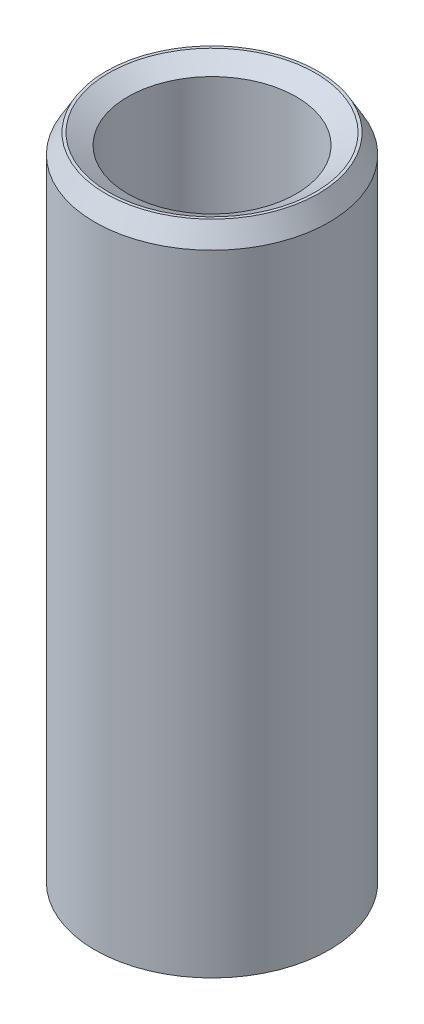
ISO-10303-21;
HEADER;
FILE_DESCRIPTION(('STEP AP214'),'2;1');
FILE_NAME('part.step','',(''),(''),'','','');
FILE_SCHEMA(('AUTOMOTIVE_DESIGN { 1 0 10303 214 1 1 1 1 }'));
ENDSEC;
DATA;
#1=APPLICATION_CONTEXT('core data for automotive mechanical design processes');
#2=APPLICATION_PROTOCOL_DEFINITION('international standard','automotive_design',2000,#1);
#3=PRODUCT_CONTEXT('',#1,'mechanical');
#4=PRODUCT('Part','Part','',(#3));
#5=PRODUCT_RELATED_PRODUCT_CATEGORY('part','',(#4));
#6=PRODUCT_DEFINITION_FORMATION('','',#4);
#7=PRODUCT_DEFINITION_CONTEXT('part definition',#1,'design');
#8=PRODUCT_DEFINITION('design','',#6,#7);
#9=PRODUCT_DEFINITION_SHAPE('','',#8);
#10=(LENGTH_UNIT() NAMED_UNIT(*) SI_UNIT(.MILLI.,.METRE.));
#11=(NAMED_UNIT(*) PLANE_ANGLE_UNIT() SI_UNIT($,.RADIAN.));
#12=(NAMED_UNIT(*) SI_UNIT($,.STERADIAN.) SOLID_ANGLE_UNIT());
#13=UNCERTAINTY_MEASURE_WITH_UNIT(LENGTH_MEASURE(1.E-05),#10,'distance_accuracy_value','');
#14=(GEOMETRIC_REPRESENTATION_CONTEXT(3) GLOBAL_UNCERTAINTY_ASSIGNED_CONTEXT((#13)) GLOBAL_UNIT_ASSIGNED_CONTEXT((#10,
#11,#12)) REPRESENTATION_CONTEXT('',''));
#15=CARTESIAN_POINT('',(0.,0.,0.));
#16=DIRECTION('',(0.,0.,1.));
#17=DIRECTION('',(1.,0.,0.));
#18=AXIS2_PLACEMENT_3D('',#15,#16,#17);
#19=CARTESIAN_POINT('',(0.,56.3639737341303,0.));
#20=DIRECTION('',(0.,-1.,0.));
#21=DIRECTION('',(0.,0.,-1.));
#22=AXIS2_PLACEMENT_3D('',#19,#20,#21);
#23=CYLINDRICAL_SURFACE('',#22,10.);
#24=CARTESIAN_POINT('',(0.,0.941735988962779,0.));
#25=DIRECTION('',(0.,1.,0.));
#26=DIRECTION('',(0.,0.,1.));
#27=AXIS2_PLACEMENT_3D('',#24,#25,#26);
#28=CIRCLE('',#27,10.);
#29=CARTESIAN_POINT('',(0.,0.941735988962779,10.));
#30=VERTEX_POINT('',#29);
#31=EDGE_CURVE('E10',#30,#30,#28,.T.);
#32=ORIENTED_EDGE('',*,*,#31,.T.);
#33=EDGE_LOOP('',(#32));
#34=FACE_BOUND('',#33,.T.);
#35=CARTESIAN_POINT('',(0.,54.7328391539306,0.));
#36=DIRECTION('',(0.,1.,0.));
#37=DIRECTION('',(0.,0.,1.));
#38=AXIS2_PLACEMENT_3D('',#35,#36,#37);
#39=CIRCLE('',#38,10.);
#40=CARTESIAN_POINT('',(0.,54.7328391539306,10.));
#41=VERTEX_POINT('',#40);
#42=EDGE_CURVE('E50',#41,#41,#39,.F.);
#43=ORIENTED_EDGE('',*,*,#42,.T.);
#44=EDGE_LOOP('',(#43));
#45=FACE_BOUND('',#44,.T.);
#46=ADVANCED_FACE('F39',(#34,#45),#23,.T.);
#47=CARTESIAN_POINT('',(0.,56.3639737341303,0.));
#48=DIRECTION('',(0.,1.,0.));
#49=DIRECTION('',(0.,0.,1.));
#50=AXIS2_PLACEMENT_3D('',#47,#48,#49);
#51=PLANE('',#50);
#52=CARTESIAN_POINT('',(0.,56.3639737341303,0.));
#53=DIRECTION('',(0.,1.,0.));
#54=DIRECTION('',(0.,0.,1.));
#55=AXIS2_PLACEMENT_3D('',#52,#53,#54);
#56=CIRCLE('',#55,8.81655280088586);
#57=CARTESIAN_POINT('',(0.,56.3639737341303,8.81655280088586));
#58=VERTEX_POINT('',#57);
#59=EDGE_CURVE('E58',#58,#58,#56,.F.);
#60=ORIENTED_EDGE('',*,*,#59,.T.);
#61=EDGE_LOOP('',(#60));
#62=FACE_BOUND('',#61,.T.);
#63=CARTESIAN_POINT('',(0.,56.3639737341303,0.));
#64=DIRECTION('',(0.,1.,0.));
#65=DIRECTION('',(0.,0.,1.));
#66=AXIS2_PLACEMENT_3D('',#63,#64,#65);
#67=CIRCLE('',#66,9.05826401103721);
#68=CARTESIAN_POINT('',(0.,56.3639737341303,9.05826401103721));
#69=VERTEX_POINT('',#68);
#70=EDGE_CURVE('E61',#69,#69,#67,.T.);
#71=ORIENTED_EDGE('',*,*,#70,.T.);
#72=EDGE_LOOP('',(#71));
#73=FACE_BOUND('',#72,.T.);
#74=ADVANCED_FACE('F88',(#62,#73),#51,.T.);
#75=CARTESIAN_POINT('',(0.,0.,0.));
#76=DIRECTION('',(0.,1.,0.));
#77=DIRECTION('',(0.,0.,1.));
#78=AXIS2_PLACEMENT_3D('',#75,#76,#77);
#79=PLANE('',#78);
#80=CARTESIAN_POINT('',(0.,0.,0.));
#81=DIRECTION('',(0.,1.,0.));
#82=DIRECTION('',(0.,0.,1.));
#83=AXIS2_PLACEMENT_3D('',#80,#81,#82);
#84=CIRCLE('',#83,8.12715420964898);
#85=CARTESIAN_POINT('',(0.,0.,-8.12715420964898));
#86=VERTEX_POINT('',#85);
#87=EDGE_CURVE('E51',#86,#86,#84,.T.);
#88=ORIENTED_EDGE('',*,*,#87,.T.);
#89=EDGE_LOOP('',(#88));
#90=FACE_BOUND('',#89,.T.);
#91=CARTESIAN_POINT('',(0.,0.,0.));
#92=DIRECTION('',(0.,1.,0.));
#93=DIRECTION('',(0.,0.,1.));
#94=AXIS2_PLACEMENT_3D('',#91,#92,#93);
#95=CIRCLE('',#94,8.36886541980034);
#96=CARTESIAN_POINT('',(0.,0.,8.36886541980034));
#97=VERTEX_POINT('',#96);
#98=EDGE_CURVE('E54',#97,#97,#95,.F.);
#99=ORIENTED_EDGE('',*,*,#98,.T.);
#100=EDGE_LOOP('',(#99));
#101=FACE_BOUND('',#100,.T.);
#102=ADVANCED_FACE('F83',(#90,#101),#79,.F.);
#103=CARTESIAN_POINT('',(0.,56.3639737341303,0.));
#104=DIRECTION('',(0.,-1.,0.));
#105=DIRECTION('',(0.,0.,-1.));
#106=AXIS2_PLACEMENT_3D('',#103,#104,#105);
#107=CYLINDRICAL_SURFACE('',#106,7.1854182206862);
#108=CARTESIAN_POINT('',(0.,55.4222377451675,0.));
#109=DIRECTION('',(0.,1.,0.));
#110=DIRECTION('',(0.,0.,1.));
#111=AXIS2_PLACEMENT_3D('',#108,#109,#110);
#112=CIRCLE('',#111,7.1854182206862);
#113=CARTESIAN_POINT('',(0.,55.4222377451675,7.1854182206862));
#114=VERTEX_POINT('',#113);
#115=EDGE_CURVE('E67',#114,#114,#112,.T.);
#116=ORIENTED_EDGE('',*,*,#115,.T.);
#117=EDGE_LOOP('',(#116));
#118=FACE_BOUND('',#117,.T.);
#119=CARTESIAN_POINT('',(0.,1.63113458019967,0.));
#120=DIRECTION('',(0.,1.,0.));
#121=DIRECTION('',(0.,0.,1.));
#122=AXIS2_PLACEMENT_3D('',#119,#120,#121);
#123=CIRCLE('',#122,7.1854182206862);
#124=CARTESIAN_POINT('',(0.,1.63113458019967,-7.1854182206862));
#125=VERTEX_POINT('',#124);
#126=EDGE_CURVE('E69',#125,#125,#123,.F.);
#127=ORIENTED_EDGE('',*,*,#126,.T.);
#128=EDGE_LOOP('',(#127));
#129=FACE_BOUND('',#128,.T.);
#130=ADVANCED_FACE('F71',(#118,#129),#107,.F.);
#131=CARTESIAN_POINT('',(0.,55.4222377451675,0.));
#132=DIRECTION('',(0.,1.,0.));
#133=DIRECTION('',(0.,0.,1.));
#134=AXIS2_PLACEMENT_3D('',#131,#132,#133);
#135=CONICAL_SURFACE('',#134,7.1854182206862,1.0471975511966);
#136=ORIENTED_EDGE('',*,*,#59,.F.);
#137=EDGE_LOOP('',(#136));
#138=FACE_BOUND('',#137,.T.);
#139=ORIENTED_EDGE('',*,*,#115,.F.);
#140=EDGE_LOOP('',(#139));
#141=FACE_BOUND('',#140,.T.);
#142=ADVANCED_FACE('F77',(#138,#141),#135,.F.);
#143=CARTESIAN_POINT('',(0.,0.,0.));
#144=DIRECTION('',(0.,-1.,0.));
#145=DIRECTION('',(0.,0.,-1.));
#146=AXIS2_PLACEMENT_3D('',#143,#144,#145);
#147=CONICAL_SURFACE('',#146,8.12715420964898,0.523598775598295);
#148=CARTESIAN_POINT('',(0.,1.63113458019967,-7.1854182206862));
#149=CARTESIAN_POINT('',(0.,1.61414359498926,-7.19522797057123));
#150=CARTESIAN_POINT('',(0.,1.59715260977885,-7.20503772045626));
#151=CARTESIAN_POINT('',(0.,1.56317063935802,-7.22465722022632));
#152=CARTESIAN_POINT('',(0.,1.54617965414761,-7.23446697011134));
#153=CARTESIAN_POINT('',(0.,1.51219768372678,-7.2540864698814));
#154=CARTESIAN_POINT('',(0.,1.49520669851637,-7.26389621976643));
#155=CARTESIAN_POINT('',(0.,1.46122472809554,-7.28351571953649));
#156=CARTESIAN_POINT('',(0.,1.44423374288513,-7.29332546942152));
#157=CARTESIAN_POINT('',(0.,1.4102517724643,-7.31294496919158));
#158=CARTESIAN_POINT('',(0.,1.39326078725389,-7.32275471907661));
#159=CARTESIAN_POINT('',(0.,1.35927881683306,-7.34237421884666));
#160=CARTESIAN_POINT('',(0.,1.34228783162265,-7.35218396873169));
#161=CARTESIAN_POINT('',(0.,1.30830586120182,-7.37180346850175));
#162=CARTESIAN_POINT('',(0.,1.29131487599141,-7.38161321838678));
#163=CARTESIAN_POINT('',(0.,1.25733290557058,-7.40123271815684));
#164=CARTESIAN_POINT('',(0.,1.24034192036017,-7.41104246804187));
#165=CARTESIAN_POINT('',(0.,1.20635994993934,-7.43066196781192));
#166=CARTESIAN_POINT('',(0.,1.18936896472893,-7.44047171769695));
#167=CARTESIAN_POINT('',(0.,1.1553869943081,-7.46009121746701));
#168=CARTESIAN_POINT('',(0.,1.13839600909769,-7.46990096735204));
#169=CARTESIAN_POINT('',(0.,1.10441403867686,-7.4895204671221));
#170=CARTESIAN_POINT('',(0.,1.08742305346645,-7.49933021700713));
#171=CARTESIAN_POINT('',(0.,1.05344108304562,-7.51894971677719));
#172=CARTESIAN_POINT('',(0.,1.03645009783521,-7.52875946666221));
#173=CARTESIAN_POINT('',(0.,1.00246812741438,-7.54837896643227));
#174=CARTESIAN_POINT('',(0.,0.985477142203968,-7.5581887163173));
#175=CARTESIAN_POINT('',(0.,0.951495171783142,-7.57780821608736));
#176=CARTESIAN_POINT('',(0.,0.934504186572729,-7.58761796597239));
#177=CARTESIAN_POINT('',(0.,0.900522216151902,-7.60723746574245));
#178=CARTESIAN_POINT('',(0.,0.883531230941489,-7.61704721562748));
#179=CARTESIAN_POINT('',(0.,0.849549260520663,-7.63666671539753));
#180=CARTESIAN_POINT('',(0.,0.832558275310249,-7.64647646528256));
#181=CARTESIAN_POINT('',(0.,0.798576304889423,-7.66609596505262));
#182=CARTESIAN_POINT('',(0.,0.78158531967901,-7.67590571493765));
#183=CARTESIAN_POINT('',(0.,0.747603349258183,-7.69552521470771));
#184=CARTESIAN_POINT('',(0.,0.73061236404777,-7.70533496459274));
#185=CARTESIAN_POINT('',(0.,0.696630393626943,-7.72495446436279));
#186=CARTESIAN_POINT('',(0.,0.67963940841653,-7.73476421424782));
#187=CARTESIAN_POINT('',(0.,0.645657437995704,-7.75438371401788));
#188=CARTESIAN_POINT('',(0.,0.62866645278529,-7.76419346390291));
#189=CARTESIAN_POINT('',(0.,0.594684482364464,-7.78381296367297));
#190=CARTESIAN_POINT('',(0.,0.57769349715405,-7.79362271355799));
#191=CARTESIAN_POINT('',(0.,0.543711526733224,-7.81324221332805));
#192=CARTESIAN_POINT('',(0.,0.526720541522811,-7.82305196321308));
#193=CARTESIAN_POINT('',(0.,0.492738571101984,-7.84267146298314));
#194=CARTESIAN_POINT('',(0.,0.475747585891571,-7.85248121286817));
#195=CARTESIAN_POINT('',(0.,0.441765615470744,-7.87210071263823));
#196=CARTESIAN_POINT('',(0.,0.424774630260331,-7.88191046252326));
#197=CARTESIAN_POINT('',(0.,0.390792659839505,-7.90152996229331));
#198=CARTESIAN_POINT('',(0.,0.373801674629092,-7.91133971217834));
#199=CARTESIAN_POINT('',(0.,0.339819704208265,-7.9309592119484));
#200=CARTESIAN_POINT('',(0.,0.322828718997852,-7.94076896183343));
#201=CARTESIAN_POINT('',(0.,0.288846748577025,-7.96038846160349));
#202=CARTESIAN_POINT('',(0.,0.271855763366612,-7.97019821148852));
#203=CARTESIAN_POINT('',(0.,0.237873792945786,-7.98981771125857));
#204=CARTESIAN_POINT('',(0.,0.220882807735372,-7.9996274611436));
#205=CARTESIAN_POINT('',(0.,0.186900837314546,-8.01924696091366));
#206=CARTESIAN_POINT('',(0.,0.169909852104132,-8.02905671079869));
#207=CARTESIAN_POINT('',(0.,0.135927881683306,-8.04867621056875));
#208=CARTESIAN_POINT('',(0.,0.118936896472893,-8.05848596045378));
#209=CARTESIAN_POINT('',(0.,0.0849549260520664,-8.07810546022383));
#210=CARTESIAN_POINT('',(0.,0.067963940841653,-8.08791521010886));
#211=CARTESIAN_POINT('',(0.,0.0339819704208262,-8.10753470987892));
#212=CARTESIAN_POINT('',(0.,0.0169909852104128,-8.11734445976395));
#213=CARTESIAN_POINT('',(0.,0.,-8.12715420964898));
#214=B_SPLINE_CURVE_WITH_KNOTS('',3,(#148,#149,#150,#151,#152,#153,#154,#155,#156,#157,#158,
#159,#160,#161,#162,#163,#164,#165,#166,#167,#168,#169,#170,#171,#172,#173,#174,#175,#176,#177,
#178,#179,#180,#181,#182,#183,#184,#185,#186,#187,#188,#189,#190,#191,#192,#193,#194,#195,#196,
#197,#198,#199,#200,#201,#202,#203,#204,#205,#206,#207,#208,#209,#210,#211,#212,#213),
.UNSPECIFIED.,.F.,.F.,(4,2,2,2,2,2,2,2,2,2,2,2,2,2,2,2,2,2,2,2,2,2,2,2,2,2,2,2,2,2,2,2,4),(0.,
0.058858499310174,0.117716998620348,0.176575497930522,0.235433997240696,0.29429249655087,
0.353150995861045,0.412009495171219,0.470867994481393,0.529726493791567,0.588584993101741,
0.647443492411915,0.706301991722089,0.765160491032263,0.824018990342438,0.882877489652612,
0.941735988962786,1.00059448827296,1.05945298758313,1.11831148689331,1.17716998620348,
1.23602848551366,1.29488698482383,1.353745484134,1.41260398344418,1.47146248275435,
1.53032098206453,1.5891794813747,1.64803798068488,1.70689647999505,1.76575497930522,
1.8246134786154,1.88347197792557),.UNSPECIFIED.);
#215=EDGE_CURVE('BSEAM73',#125,#86,#214,.T.);
#216=ORIENTED_EDGE('',*,*,#126,.F.);
#217=ORIENTED_EDGE('',*,*,#87,.F.);
#218=ORIENTED_EDGE('',*,*,#215,.T.);
#219=ORIENTED_EDGE('',*,*,#215,.F.);
#220=EDGE_LOOP('',(#216,#218,#217,#219));
#221=FACE_BOUND('',#220,.T.);
#222=ADVANCED_FACE('F73',(#221),#147,.F.);
#223=CARTESIAN_POINT('',(0.,0.941735988962779,0.));
#224=DIRECTION('',(0.,1.,0.));
#225=DIRECTION('',(0.,0.,1.));
#226=AXIS2_PLACEMENT_3D('',#223,#224,#225);
#227=CONICAL_SURFACE('',#226,10.,1.0471975511966);
#228=ORIENTED_EDGE('',*,*,#98,.F.);
#229=EDGE_LOOP('',(#228));
#230=FACE_BOUND('',#229,.T.);
#231=ORIENTED_EDGE('',*,*,#31,.F.);
#232=EDGE_LOOP('',(#231));
#233=FACE_BOUND('',#232,.T.);
#234=ADVANCED_FACE('F76',(#230,#233),#227,.T.);
#235=CARTESIAN_POINT('',(0.,56.3639737341303,0.));
#236=DIRECTION('',(0.,-1.,0.));
#237=DIRECTION('',(0.,0.,-1.));
#238=AXIS2_PLACEMENT_3D('',#235,#236,#237);
#239=CONICAL_SURFACE('',#238,9.05826401103721,0.523598775598295);
#240=ORIENTED_EDGE('',*,*,#42,.F.);
#241=EDGE_LOOP('',(#240));
#242=FACE_BOUND('',#241,.T.);
#243=ORIENTED_EDGE('',*,*,#70,.F.);
#244=EDGE_LOOP('',(#243));
#245=FACE_BOUND('',#244,.T.);
#246=ADVANCED_FACE('F45',(#242,#245),#239,.T.);
#247=CLOSED_SHELL('',(#46,#74,#102,#130,#142,#222,#234,#246));
#248=MANIFOLD_SOLID_BREP('B2',#247);
#249=ADVANCED_BREP_SHAPE_REPRESENTATION('',(#18,#248),#14);
#250=SHAPE_DEFINITION_REPRESENTATION(#9,#249);
ENDSEC;
END-ISO-10303-21;
